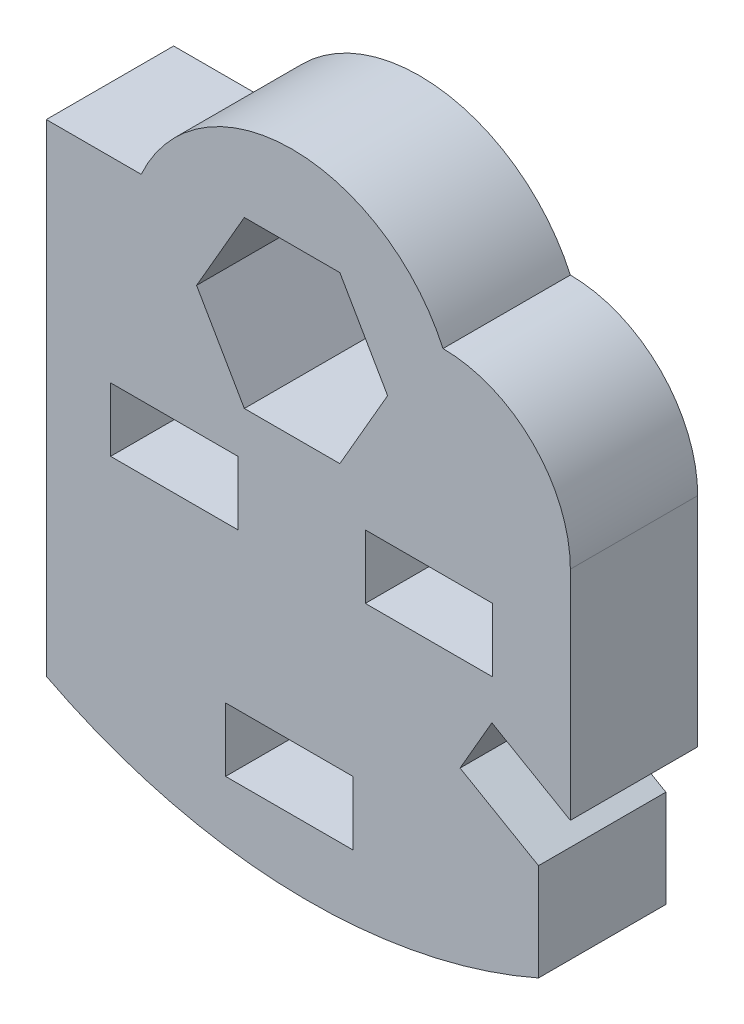
ISO-10303-21;
HEADER;
FILE_DESCRIPTION(('STEP AP214'),'2;1');
FILE_NAME('part.step','',(''),(''),'','','');
FILE_SCHEMA(('AUTOMOTIVE_DESIGN { 1 0 10303 214 1 1 1 1 }'));
ENDSEC;
DATA;
#1=APPLICATION_CONTEXT('core data for automotive mechanical design processes');
#2=APPLICATION_PROTOCOL_DEFINITION('international standard','automotive_design',2000,#1);
#3=PRODUCT_CONTEXT('',#1,'mechanical');
#4=PRODUCT('Part','Part','',(#3));
#5=PRODUCT_RELATED_PRODUCT_CATEGORY('part','',(#4));
#6=PRODUCT_DEFINITION_FORMATION('','',#4);
#7=PRODUCT_DEFINITION_CONTEXT('part definition',#1,'design');
#8=PRODUCT_DEFINITION('design','',#6,#7);
#9=PRODUCT_DEFINITION_SHAPE('','',#8);
#10=(LENGTH_UNIT() NAMED_UNIT(*) SI_UNIT(.MILLI.,.METRE.));
#11=(NAMED_UNIT(*) PLANE_ANGLE_UNIT() SI_UNIT($,.RADIAN.));
#12=(NAMED_UNIT(*) SI_UNIT($,.STERADIAN.) SOLID_ANGLE_UNIT());
#13=UNCERTAINTY_MEASURE_WITH_UNIT(LENGTH_MEASURE(1.E-05),#10,'distance_accuracy_value','');
#14=(GEOMETRIC_REPRESENTATION_CONTEXT(3) GLOBAL_UNCERTAINTY_ASSIGNED_CONTEXT((#13)) GLOBAL_UNIT_ASSIGNED_CONTEXT((#10,
#11,#12)) REPRESENTATION_CONTEXT('',''));
#15=CARTESIAN_POINT('',(0.,0.,0.));
#16=DIRECTION('',(0.,0.,1.));
#17=DIRECTION('',(1.,0.,0.));
#18=AXIS2_PLACEMENT_3D('',#15,#16,#17);
#19=CARTESIAN_POINT('',(13.9396736813884,13.1425512647541,4.));
#20=DIRECTION('',(0.,0.,1.));
#21=DIRECTION('',(1.,0.,0.));
#22=AXIS2_PLACEMENT_3D('',#19,#20,#21);
#23=PLANE('',#22);
#24=DIRECTION('',(0.,-1.,0.));
#25=VECTOR('',#24,1.);
#26=CARTESIAN_POINT('',(11.5,8.99107807997269,4.));
#27=LINE('',#26,#25);
#28=CARTESIAN_POINT('',(11.5,10.9910780799727,4.));
#29=VERTEX_POINT('',#28);
#30=CARTESIAN_POINT('',(11.5,8.99107807997269,4.));
#31=VERTEX_POINT('',#30);
#32=EDGE_CURVE('E271',#29,#31,#27,.T.);
#33=ORIENTED_EDGE('',*,*,#32,.F.);
#34=DIRECTION('',(-1.,0.,0.));
#35=VECTOR('',#34,1.);
#36=CARTESIAN_POINT('',(11.5,10.9910780799727,4.));
#37=LINE('',#36,#35);
#38=CARTESIAN_POINT('',(15.5,10.9910780799727,4.));
#39=VERTEX_POINT('',#38);
#40=EDGE_CURVE('E269',#39,#29,#37,.T.);
#41=ORIENTED_EDGE('',*,*,#40,.F.);
#42=DIRECTION('',(0.,1.,0.));
#43=VECTOR('',#42,1.);
#44=CARTESIAN_POINT('',(15.5,8.99107807997269,4.));
#45=LINE('',#44,#43);
#46=CARTESIAN_POINT('',(15.5,8.99107807997269,4.));
#47=VERTEX_POINT('',#46);
#48=EDGE_CURVE('E277',#47,#39,#45,.T.);
#49=ORIENTED_EDGE('',*,*,#48,.F.);
#50=DIRECTION('',(1.,0.,0.));
#51=VECTOR('',#50,1.);
#52=CARTESIAN_POINT('',(11.5,8.99107807997269,4.));
#53=LINE('',#52,#51);
#54=EDGE_CURVE('E274',#31,#47,#53,.T.);
#55=ORIENTED_EDGE('',*,*,#54,.F.);
#56=EDGE_LOOP('',(#33,#41,#49,#55));
#57=FACE_BOUND('',#56,.T.);
#58=DIRECTION('',(0.,-1.,0.));
#59=VECTOR('',#58,1.);
#60=CARTESIAN_POINT('',(7.11105611722977,2.0910780799727,4.));
#61=LINE('',#60,#59);
#62=CARTESIAN_POINT('',(7.11105611722977,4.0910780799727,4.));
#63=VERTEX_POINT('',#62);
#64=CARTESIAN_POINT('',(7.11105611722977,2.0910780799727,4.));
#65=VERTEX_POINT('',#64);
#66=EDGE_CURVE('E333',#63,#65,#61,.T.);
#67=ORIENTED_EDGE('',*,*,#66,.F.);
#68=DIRECTION('',(-1.,0.,0.));
#69=VECTOR('',#68,1.);
#70=CARTESIAN_POINT('',(7.11105611722977,4.0910780799727,4.));
#71=LINE('',#70,#69);
#72=CARTESIAN_POINT('',(11.1110561172298,4.0910780799727,4.));
#73=VERTEX_POINT('',#72);
#74=EDGE_CURVE('E331',#73,#63,#71,.T.);
#75=ORIENTED_EDGE('',*,*,#74,.F.);
#76=DIRECTION('',(0.,1.,0.));
#77=VECTOR('',#76,1.);
#78=CARTESIAN_POINT('',(11.1110561172298,2.0910780799727,4.));
#79=LINE('',#78,#77);
#80=CARTESIAN_POINT('',(11.1110561172298,2.0910780799727,4.));
#81=VERTEX_POINT('',#80);
#82=EDGE_CURVE('E339',#81,#73,#79,.T.);
#83=ORIENTED_EDGE('',*,*,#82,.F.);
#84=DIRECTION('',(1.,0.,0.));
#85=VECTOR('',#84,1.);
#86=CARTESIAN_POINT('',(7.11105611722977,2.0910780799727,4.));
#87=LINE('',#86,#85);
#88=EDGE_CURVE('E336',#65,#81,#87,.T.);
#89=ORIENTED_EDGE('',*,*,#88,.F.);
#90=EDGE_LOOP('',(#67,#75,#83,#89));
#91=FACE_BOUND('',#90,.T.);
#92=CARTESIAN_POINT('',(13.9396736813884,13.1425512647541,4.));
#93=DIRECTION('',(0.,0.,1.));
#94=DIRECTION('',(1.,0.,0.));
#95=AXIS2_PLACEMENT_3D('',#92,#93,#94);
#96=CIRCLE('',#95,4.);
#97=CARTESIAN_POINT('',(17.9396736813884,13.142551264754,4.));
#98=VERTEX_POINT('',#97);
#99=CARTESIAN_POINT('',(13.9396736813883,17.1425512647541,4.));
#100=VERTEX_POINT('',#99);
#101=EDGE_CURVE('E362',#98,#100,#96,.T.);
#102=ORIENTED_EDGE('',*,*,#101,.T.);
#103=CARTESIAN_POINT('',(9.20000000000002,14.992551264754,4.));
#104=DIRECTION('',(0.,0.,1.));
#105=DIRECTION('',(1.,0.,0.));
#106=AXIS2_PLACEMENT_3D('',#103,#104,#105);
#107=CIRCLE('',#106,5.20451790332642);
#108=CARTESIAN_POINT('',(4.46032631861171,17.1425512647541,4.));
#109=VERTEX_POINT('',#108);
#110=EDGE_CURVE('E365',#100,#109,#107,.T.);
#111=ORIENTED_EDGE('',*,*,#110,.T.);
#112=DIRECTION('',(-1.,0.,0.));
#113=VECTOR('',#112,1.);
#114=CARTESIAN_POINT('',(4.46032631861171,17.1425512647541,4.));
#115=LINE('',#114,#113);
#116=CARTESIAN_POINT('',(1.48,17.1425512647541,4.));
#117=VERTEX_POINT('',#116);
#118=EDGE_CURVE('E368',#109,#117,#115,.T.);
#119=ORIENTED_EDGE('',*,*,#118,.T.);
#120=DIRECTION('',(0.,-1.,0.));
#121=VECTOR('',#120,1.);
#122=CARTESIAN_POINT('',(1.48,17.1425512647541,4.));
#123=LINE('',#122,#121);
#124=CARTESIAN_POINT('',(1.47999999999999,2.,4.));
#125=VERTEX_POINT('',#124);
#126=EDGE_CURVE('E370',#117,#125,#123,.T.);
#127=ORIENTED_EDGE('',*,*,#126,.T.);
#128=CARTESIAN_POINT('',(9.70983684069418,17.9325536061118,4.));
#129=DIRECTION('',(0.,0.,1.));
#130=DIRECTION('',(1.,0.,0.));
#131=AXIS2_PLACEMENT_3D('',#128,#129,#130);
#132=CIRCLE('',#131,17.9325536061118);
#133=CARTESIAN_POINT('',(16.9396736813884,1.52201010222338,4.));
#134=VERTEX_POINT('',#133);
#135=EDGE_CURVE('E372',#125,#134,#132,.T.);
#136=ORIENTED_EDGE('',*,*,#135,.T.);
#137=DIRECTION('',(0.,1.,0.));
#138=VECTOR('',#137,1.);
#139=CARTESIAN_POINT('',(16.9396736813884,4.57735026918963,4.));
#140=LINE('',#139,#138);
#141=CARTESIAN_POINT('',(16.9396736813884,4.57735026918963,4.));
#142=VERTEX_POINT('',#141);
#143=EDGE_CURVE('E374',#134,#142,#140,.T.);
#144=ORIENTED_EDGE('',*,*,#143,.T.);
#145=DIRECTION('',(-0.866025403784438,0.5,0.));
#146=VECTOR('',#145,1.);
#147=CARTESIAN_POINT('',(14.4755720662506,6.,4.));
#148=LINE('',#147,#146);
#149=CARTESIAN_POINT('',(14.4755720662506,6.,4.));
#150=VERTEX_POINT('',#149);
#151=EDGE_CURVE('E376',#142,#150,#148,.T.);
#152=ORIENTED_EDGE('',*,*,#151,.T.);
#153=DIRECTION('',(0.500000000000005,0.866025403784436,0.));
#154=VECTOR('',#153,1.);
#155=CARTESIAN_POINT('',(14.4755720662506,6.,4.));
#156=LINE('',#155,#154);
#157=CARTESIAN_POINT('',(15.4755720662506,7.73205080756889,4.));
#158=VERTEX_POINT('',#157);
#159=EDGE_CURVE('E378',#150,#158,#156,.T.);
#160=ORIENTED_EDGE('',*,*,#159,.T.);
#161=DIRECTION('',(0.866025403784436,-0.500000000000005,0.));
#162=VECTOR('',#161,1.);
#163=CARTESIAN_POINT('',(15.4755720662506,7.73205080756889,4.));
#164=LINE('',#163,#162);
#165=CARTESIAN_POINT('',(17.9396736813884,6.30940107675851,4.));
#166=VERTEX_POINT('',#165);
#167=EDGE_CURVE('E380',#158,#166,#164,.T.);
#168=ORIENTED_EDGE('',*,*,#167,.T.);
#169=DIRECTION('',(0.,1.,0.));
#170=VECTOR('',#169,1.);
#171=CARTESIAN_POINT('',(17.9396736813884,13.142551264754,4.));
#172=LINE('',#171,#170);
#173=EDGE_CURVE('E382',#166,#98,#172,.T.);
#174=ORIENTED_EDGE('',*,*,#173,.T.);
#175=EDGE_LOOP('',(#102,#111,#119,#127,#136,#144,#152,#160,#168,#174));
#176=FACE_BOUND('',#175,.T.);
#177=DIRECTION('',(0.,-1.,0.));
#178=VECTOR('',#177,1.);
#179=CARTESIAN_POINT('',(3.5,8.99107807997269,4.));
#180=LINE('',#179,#178);
#181=CARTESIAN_POINT('',(3.5,10.9910780799727,4.));
#182=VERTEX_POINT('',#181);
#183=CARTESIAN_POINT('',(3.5,8.99107807997269,4.));
#184=VERTEX_POINT('',#183);
#185=EDGE_CURVE('E302',#182,#184,#180,.T.);
#186=ORIENTED_EDGE('',*,*,#185,.F.);
#187=DIRECTION('',(-1.,0.,0.));
#188=VECTOR('',#187,1.);
#189=CARTESIAN_POINT('',(3.5,10.9910780799727,4.));
#190=LINE('',#189,#188);
#191=CARTESIAN_POINT('',(7.5,10.9910780799727,4.));
#192=VERTEX_POINT('',#191);
#193=EDGE_CURVE('E300',#192,#182,#190,.T.);
#194=ORIENTED_EDGE('',*,*,#193,.F.);
#195=DIRECTION('',(0.,1.,0.));
#196=VECTOR('',#195,1.);
#197=CARTESIAN_POINT('',(7.5,8.99107807997269,4.));
#198=LINE('',#197,#196);
#199=CARTESIAN_POINT('',(7.5,8.99107807997269,4.));
#200=VERTEX_POINT('',#199);
#201=EDGE_CURVE('E308',#200,#192,#198,.T.);
#202=ORIENTED_EDGE('',*,*,#201,.F.);
#203=DIRECTION('',(1.,0.,0.));
#204=VECTOR('',#203,1.);
#205=CARTESIAN_POINT('',(3.5,8.99107807997269,4.));
#206=LINE('',#205,#204);
#207=EDGE_CURVE('E305',#184,#200,#206,.T.);
#208=ORIENTED_EDGE('',*,*,#207,.F.);
#209=EDGE_LOOP('',(#186,#194,#202,#208));
#210=FACE_BOUND('',#209,.T.);
#211=DIRECTION('',(0.500000000000001,-0.866025403784438,0.));
#212=VECTOR('',#211,1.);
#213=CARTESIAN_POINT('',(6.20000000000001,14.9910780799727,4.));
#214=LINE('',#213,#212);
#215=CARTESIAN_POINT('',(6.20000000000001,14.9910780799727,4.));
#216=VERTEX_POINT('',#215);
#217=CARTESIAN_POINT('',(7.70000000000002,12.3930018686194,4.));
#218=VERTEX_POINT('',#217);
#219=EDGE_CURVE('E226',#216,#218,#214,.T.);
#220=ORIENTED_EDGE('',*,*,#219,.F.);
#221=DIRECTION('',(-0.499999999999995,-0.866025403784442,0.));
#222=VECTOR('',#221,1.);
#223=CARTESIAN_POINT('',(7.69999999999998,17.589154291326,4.));
#224=LINE('',#223,#222);
#225=CARTESIAN_POINT('',(7.69999999999998,17.589154291326,4.));
#226=VERTEX_POINT('',#225);
#227=EDGE_CURVE('E218',#226,#216,#224,.T.);
#228=ORIENTED_EDGE('',*,*,#227,.F.);
#229=DIRECTION('',(-1.,0.,0.));
#230=VECTOR('',#229,1.);
#231=CARTESIAN_POINT('',(10.7,17.589154291326,4.));
#232=LINE('',#231,#230);
#233=CARTESIAN_POINT('',(10.7,17.589154291326,4.));
#234=VERTEX_POINT('',#233);
#235=EDGE_CURVE('E247',#234,#226,#232,.T.);
#236=ORIENTED_EDGE('',*,*,#235,.F.);
#237=DIRECTION('',(-0.500000000000007,0.866025403784435,0.));
#238=VECTOR('',#237,1.);
#239=CARTESIAN_POINT('',(12.2,14.9910780799727,4.));
#240=LINE('',#239,#238);
#241=CARTESIAN_POINT('',(12.2,14.9910780799727,4.));
#242=VERTEX_POINT('',#241);
#243=EDGE_CURVE('E245',#242,#234,#240,.T.);
#244=ORIENTED_EDGE('',*,*,#243,.F.);
#245=DIRECTION('',(0.499999999999995,0.866025403784442,0.));
#246=VECTOR('',#245,1.);
#247=CARTESIAN_POINT('',(10.7,12.3930018686194,4.));
#248=LINE('',#247,#246);
#249=CARTESIAN_POINT('',(10.7,12.3930018686194,4.));
#250=VERTEX_POINT('',#249);
#251=EDGE_CURVE('E241',#250,#242,#248,.T.);
#252=ORIENTED_EDGE('',*,*,#251,.F.);
#253=DIRECTION('',(1.,0.,0.));
#254=VECTOR('',#253,1.);
#255=CARTESIAN_POINT('',(7.70000000000002,12.3930018686194,4.));
#256=LINE('',#255,#254);
#257=EDGE_CURVE('E239',#218,#250,#256,.T.);
#258=ORIENTED_EDGE('',*,*,#257,.F.);
#259=EDGE_LOOP('',(#220,#228,#236,#244,#252,#258));
#260=FACE_BOUND('',#259,.T.);
#261=ADVANCED_FACE('F33',(#57,#91,#176,#210,#260),#23,.T.);
#262=CARTESIAN_POINT('',(13.9396736813884,13.1425512647541,0.));
#263=DIRECTION('',(0.,0.,1.));
#264=DIRECTION('',(1.,0.,0.));
#265=AXIS2_PLACEMENT_3D('',#262,#263,#264);
#266=PLANE('',#265);
#267=DIRECTION('',(-1.,0.,0.));
#268=VECTOR('',#267,1.);
#269=CARTESIAN_POINT('',(11.5,10.9910780799727,0.));
#270=LINE('',#269,#268);
#271=CARTESIAN_POINT('',(15.5,10.9910780799727,0.));
#272=VERTEX_POINT('',#271);
#273=CARTESIAN_POINT('',(11.5,10.9910780799727,0.));
#274=VERTEX_POINT('',#273);
#275=EDGE_CURVE('E234',#272,#274,#270,.T.);
#276=ORIENTED_EDGE('',*,*,#275,.T.);
#277=DIRECTION('',(0.,-1.,0.));
#278=VECTOR('',#277,1.);
#279=CARTESIAN_POINT('',(11.5,8.99107807997269,0.));
#280=LINE('',#279,#278);
#281=CARTESIAN_POINT('',(11.5,8.99107807997269,0.));
#282=VERTEX_POINT('',#281);
#283=EDGE_CURVE('E282',#274,#282,#280,.T.);
#284=ORIENTED_EDGE('',*,*,#283,.T.);
#285=DIRECTION('',(1.,0.,0.));
#286=VECTOR('',#285,1.);
#287=CARTESIAN_POINT('',(11.5,8.99107807997269,0.));
#288=LINE('',#287,#286);
#289=CARTESIAN_POINT('',(15.5,8.99107807997269,0.));
#290=VERTEX_POINT('',#289);
#291=EDGE_CURVE('E285',#282,#290,#288,.T.);
#292=ORIENTED_EDGE('',*,*,#291,.T.);
#293=DIRECTION('',(0.,1.,0.));
#294=VECTOR('',#293,1.);
#295=CARTESIAN_POINT('',(15.5,8.99107807997269,0.));
#296=LINE('',#295,#294);
#297=EDGE_CURVE('E272',#290,#272,#296,.T.);
#298=ORIENTED_EDGE('',*,*,#297,.T.);
#299=EDGE_LOOP('',(#276,#284,#292,#298));
#300=FACE_BOUND('',#299,.T.);
#301=DIRECTION('',(-1.,0.,0.));
#302=VECTOR('',#301,1.);
#303=CARTESIAN_POINT('',(7.11105611722977,4.0910780799727,0.));
#304=LINE('',#303,#302);
#305=CARTESIAN_POINT('',(11.1110561172298,4.0910780799727,0.));
#306=VERTEX_POINT('',#305);
#307=CARTESIAN_POINT('',(7.11105611722977,4.0910780799727,0.));
#308=VERTEX_POINT('',#307);
#309=EDGE_CURVE('E330',#306,#308,#304,.T.);
#310=ORIENTED_EDGE('',*,*,#309,.T.);
#311=DIRECTION('',(0.,-1.,0.));
#312=VECTOR('',#311,1.);
#313=CARTESIAN_POINT('',(7.11105611722977,2.0910780799727,0.));
#314=LINE('',#313,#312);
#315=CARTESIAN_POINT('',(7.11105611722977,2.0910780799727,0.));
#316=VERTEX_POINT('',#315);
#317=EDGE_CURVE('E344',#308,#316,#314,.T.);
#318=ORIENTED_EDGE('',*,*,#317,.T.);
#319=DIRECTION('',(1.,0.,0.));
#320=VECTOR('',#319,1.);
#321=CARTESIAN_POINT('',(7.11105611722977,2.0910780799727,0.));
#322=LINE('',#321,#320);
#323=CARTESIAN_POINT('',(11.1110561172298,2.0910780799727,0.));
#324=VERTEX_POINT('',#323);
#325=EDGE_CURVE('E347',#316,#324,#322,.T.);
#326=ORIENTED_EDGE('',*,*,#325,.T.);
#327=DIRECTION('',(0.,1.,0.));
#328=VECTOR('',#327,1.);
#329=CARTESIAN_POINT('',(11.1110561172298,2.0910780799727,0.));
#330=LINE('',#329,#328);
#331=EDGE_CURVE('E334',#324,#306,#330,.T.);
#332=ORIENTED_EDGE('',*,*,#331,.T.);
#333=EDGE_LOOP('',(#310,#318,#326,#332));
#334=FACE_BOUND('',#333,.T.);
#335=CARTESIAN_POINT('',(13.9396736813884,13.1425512647541,0.));
#336=DIRECTION('',(0.,0.,1.));
#337=DIRECTION('',(1.,0.,0.));
#338=AXIS2_PLACEMENT_3D('',#335,#336,#337);
#339=CIRCLE('',#338,4.);
#340=CARTESIAN_POINT('',(17.9396736813884,13.142551264754,0.));
#341=VERTEX_POINT('',#340);
#342=CARTESIAN_POINT('',(13.9396736813883,17.1425512647541,0.));
#343=VERTEX_POINT('',#342);
#344=EDGE_CURVE('E361',#341,#343,#339,.T.);
#345=ORIENTED_EDGE('',*,*,#344,.F.);
#346=DIRECTION('',(0.,1.,0.));
#347=VECTOR('',#346,1.);
#348=CARTESIAN_POINT('',(17.9396736813884,13.142551264754,0.));
#349=LINE('',#348,#347);
#350=CARTESIAN_POINT('',(17.9396736813884,6.30940107675851,0.));
#351=VERTEX_POINT('',#350);
#352=EDGE_CURVE('E366',#351,#341,#349,.T.);
#353=ORIENTED_EDGE('',*,*,#352,.F.);
#354=DIRECTION('',(0.866025403784436,-0.500000000000005,0.));
#355=VECTOR('',#354,1.);
#356=CARTESIAN_POINT('',(15.4755720662506,7.73205080756889,0.));
#357=LINE('',#356,#355);
#358=CARTESIAN_POINT('',(15.4755720662506,7.73205080756889,0.));
#359=VERTEX_POINT('',#358);
#360=EDGE_CURVE('E401',#359,#351,#357,.T.);
#361=ORIENTED_EDGE('',*,*,#360,.F.);
#362=DIRECTION('',(0.500000000000005,0.866025403784436,0.));
#363=VECTOR('',#362,1.);
#364=CARTESIAN_POINT('',(14.4755720662506,6.,0.));
#365=LINE('',#364,#363);
#366=CARTESIAN_POINT('',(14.4755720662506,6.,0.));
#367=VERTEX_POINT('',#366);
#368=EDGE_CURVE('E399',#367,#359,#365,.T.);
#369=ORIENTED_EDGE('',*,*,#368,.F.);
#370=DIRECTION('',(-0.866025403784438,0.5,0.));
#371=VECTOR('',#370,1.);
#372=CARTESIAN_POINT('',(14.4755720662506,6.,0.));
#373=LINE('',#372,#371);
#374=CARTESIAN_POINT('',(16.9396736813884,4.57735026918963,0.));
#375=VERTEX_POINT('',#374);
#376=EDGE_CURVE('E397',#375,#367,#373,.T.);
#377=ORIENTED_EDGE('',*,*,#376,.F.);
#378=DIRECTION('',(0.,1.,0.));
#379=VECTOR('',#378,1.);
#380=CARTESIAN_POINT('',(16.9396736813884,4.57735026918963,0.));
#381=LINE('',#380,#379);
#382=CARTESIAN_POINT('',(16.9396736813884,1.52201010222338,0.));
#383=VERTEX_POINT('',#382);
#384=EDGE_CURVE('E395',#383,#375,#381,.T.);
#385=ORIENTED_EDGE('',*,*,#384,.F.);
#386=CARTESIAN_POINT('',(9.70983684069418,17.9325536061118,0.));
#387=DIRECTION('',(0.,0.,1.));
#388=DIRECTION('',(1.,0.,0.));
#389=AXIS2_PLACEMENT_3D('',#386,#387,#388);
#390=CIRCLE('',#389,17.9325536061118);
#391=CARTESIAN_POINT('',(1.47999999999999,2.,0.));
#392=VERTEX_POINT('',#391);
#393=EDGE_CURVE('E393',#392,#383,#390,.T.);
#394=ORIENTED_EDGE('',*,*,#393,.F.);
#395=DIRECTION('',(0.,-1.,0.));
#396=VECTOR('',#395,1.);
#397=CARTESIAN_POINT('',(1.48,17.1425512647541,0.));
#398=LINE('',#397,#396);
#399=CARTESIAN_POINT('',(1.48,17.1425512647541,0.));
#400=VERTEX_POINT('',#399);
#401=EDGE_CURVE('E391',#400,#392,#398,.T.);
#402=ORIENTED_EDGE('',*,*,#401,.F.);
#403=DIRECTION('',(-1.,0.,0.));
#404=VECTOR('',#403,1.);
#405=CARTESIAN_POINT('',(4.46032631861171,17.1425512647541,0.));
#406=LINE('',#405,#404);
#407=CARTESIAN_POINT('',(4.46032631861171,17.1425512647541,0.));
#408=VERTEX_POINT('',#407);
#409=EDGE_CURVE('E389',#408,#400,#406,.T.);
#410=ORIENTED_EDGE('',*,*,#409,.F.);
#411=CARTESIAN_POINT('',(9.20000000000002,14.992551264754,0.));
#412=DIRECTION('',(0.,0.,1.));
#413=DIRECTION('',(1.,0.,0.));
#414=AXIS2_PLACEMENT_3D('',#411,#412,#413);
#415=CIRCLE('',#414,5.20451790332642);
#416=EDGE_CURVE('E387',#343,#408,#415,.T.);
#417=ORIENTED_EDGE('',*,*,#416,.F.);
#418=EDGE_LOOP('',(#345,#353,#361,#369,#377,#385,#394,#402,#410,#417));
#419=FACE_BOUND('',#418,.T.);
#420=DIRECTION('',(-1.,0.,0.));
#421=VECTOR('',#420,1.);
#422=CARTESIAN_POINT('',(3.5,10.9910780799727,0.));
#423=LINE('',#422,#421);
#424=CARTESIAN_POINT('',(7.5,10.9910780799727,0.));
#425=VERTEX_POINT('',#424);
#426=CARTESIAN_POINT('',(3.5,10.9910780799727,0.));
#427=VERTEX_POINT('',#426);
#428=EDGE_CURVE('E299',#425,#427,#423,.T.);
#429=ORIENTED_EDGE('',*,*,#428,.T.);
#430=DIRECTION('',(0.,-1.,0.));
#431=VECTOR('',#430,1.);
#432=CARTESIAN_POINT('',(3.5,8.99107807997269,0.));
#433=LINE('',#432,#431);
#434=CARTESIAN_POINT('',(3.5,8.99107807997269,0.));
#435=VERTEX_POINT('',#434);
#436=EDGE_CURVE('E313',#427,#435,#433,.T.);
#437=ORIENTED_EDGE('',*,*,#436,.T.);
#438=DIRECTION('',(1.,0.,0.));
#439=VECTOR('',#438,1.);
#440=CARTESIAN_POINT('',(3.5,8.99107807997269,0.));
#441=LINE('',#440,#439);
#442=CARTESIAN_POINT('',(7.5,8.99107807997269,0.));
#443=VERTEX_POINT('',#442);
#444=EDGE_CURVE('E316',#435,#443,#441,.T.);
#445=ORIENTED_EDGE('',*,*,#444,.T.);
#446=DIRECTION('',(0.,1.,0.));
#447=VECTOR('',#446,1.);
#448=CARTESIAN_POINT('',(7.5,8.99107807997269,0.));
#449=LINE('',#448,#447);
#450=EDGE_CURVE('E303',#443,#425,#449,.T.);
#451=ORIENTED_EDGE('',*,*,#450,.T.);
#452=EDGE_LOOP('',(#429,#437,#445,#451));
#453=FACE_BOUND('',#452,.T.);
#454=DIRECTION('',(-0.499999999999995,-0.866025403784442,0.));
#455=VECTOR('',#454,1.);
#456=CARTESIAN_POINT('',(7.69999999999998,17.589154291326,0.));
#457=LINE('',#456,#455);
#458=CARTESIAN_POINT('',(7.69999999999998,17.589154291326,0.));
#459=VERTEX_POINT('',#458);
#460=CARTESIAN_POINT('',(6.20000000000001,14.9910780799727,0.));
#461=VERTEX_POINT('',#460);
#462=EDGE_CURVE('E56',#459,#461,#457,.T.);
#463=ORIENTED_EDGE('',*,*,#462,.T.);
#464=DIRECTION('',(0.500000000000001,-0.866025403784438,0.));
#465=VECTOR('',#464,1.);
#466=CARTESIAN_POINT('',(6.20000000000001,14.9910780799727,0.));
#467=LINE('',#466,#465);
#468=CARTESIAN_POINT('',(7.70000000000002,12.3930018686194,0.));
#469=VERTEX_POINT('',#468);
#470=EDGE_CURVE('E233',#461,#469,#467,.T.);
#471=ORIENTED_EDGE('',*,*,#470,.T.);
#472=DIRECTION('',(1.,0.,0.));
#473=VECTOR('',#472,1.);
#474=CARTESIAN_POINT('',(7.70000000000002,12.3930018686194,0.));
#475=LINE('',#474,#473);
#476=CARTESIAN_POINT('',(10.7,12.3930018686194,0.));
#477=VERTEX_POINT('',#476);
#478=EDGE_CURVE('E251',#469,#477,#475,.T.);
#479=ORIENTED_EDGE('',*,*,#478,.T.);
#480=DIRECTION('',(0.499999999999995,0.866025403784442,0.));
#481=VECTOR('',#480,1.);
#482=CARTESIAN_POINT('',(10.7,12.3930018686194,0.));
#483=LINE('',#482,#481);
#484=CARTESIAN_POINT('',(12.2,14.9910780799727,0.));
#485=VERTEX_POINT('',#484);
#486=EDGE_CURVE('E254',#477,#485,#483,.T.);
#487=ORIENTED_EDGE('',*,*,#486,.T.);
#488=DIRECTION('',(-0.500000000000007,0.866025403784435,0.));
#489=VECTOR('',#488,1.);
#490=CARTESIAN_POINT('',(12.2,14.9910780799727,0.));
#491=LINE('',#490,#489);
#492=CARTESIAN_POINT('',(10.7,17.589154291326,0.));
#493=VERTEX_POINT('',#492);
#494=EDGE_CURVE('E257',#485,#493,#491,.T.);
#495=ORIENTED_EDGE('',*,*,#494,.T.);
#496=DIRECTION('',(-1.,0.,0.));
#497=VECTOR('',#496,1.);
#498=CARTESIAN_POINT('',(10.7,17.589154291326,0.));
#499=LINE('',#498,#497);
#500=EDGE_CURVE('E227',#493,#459,#499,.T.);
#501=ORIENTED_EDGE('',*,*,#500,.T.);
#502=EDGE_LOOP('',(#463,#471,#479,#487,#495,#501));
#503=FACE_BOUND('',#502,.T.);
#504=ADVANCED_FACE('F437',(#300,#334,#419,#453,#503),#266,.F.);
#505=CARTESIAN_POINT('',(13.9396736813884,13.1425512647541,4.));
#506=DIRECTION('',(0.,0.,-1.));
#507=DIRECTION('',(-1.,0.,0.));
#508=AXIS2_PLACEMENT_3D('',#505,#506,#507);
#509=CYLINDRICAL_SURFACE('',#508,4.);
#510=ORIENTED_EDGE('',*,*,#344,.T.);
#511=DIRECTION('',(0.,0.,-1.));
#512=VECTOR('',#511,1.);
#513=CARTESIAN_POINT('',(13.9396736813883,17.1425512647541,4.));
#514=LINE('',#513,#512);
#515=EDGE_CURVE('E11',#100,#343,#514,.T.);
#516=ORIENTED_EDGE('',*,*,#515,.F.);
#517=ORIENTED_EDGE('',*,*,#101,.F.);
#518=DIRECTION('',(0.,0.,-1.));
#519=VECTOR('',#518,1.);
#520=CARTESIAN_POINT('',(17.9396736813884,13.142551264754,4.));
#521=LINE('',#520,#519);
#522=EDGE_CURVE('E384',#98,#341,#521,.T.);
#523=ORIENTED_EDGE('',*,*,#522,.T.);
#524=EDGE_LOOP('',(#510,#516,#517,#523));
#525=FACE_BOUND('',#524,.T.);
#526=ADVANCED_FACE('F35',(#525),#509,.T.);
#527=CARTESIAN_POINT('',(9.20000000000002,14.992551264754,4.));
#528=DIRECTION('',(0.,0.,-1.));
#529=DIRECTION('',(-1.,0.,0.));
#530=AXIS2_PLACEMENT_3D('',#527,#528,#529);
#531=CYLINDRICAL_SURFACE('',#530,5.20451790332642);
#532=ORIENTED_EDGE('',*,*,#416,.T.);
#533=DIRECTION('',(0.,0.,-1.));
#534=VECTOR('',#533,1.);
#535=CARTESIAN_POINT('',(4.46032631861171,17.1425512647541,4.));
#536=LINE('',#535,#534);
#537=EDGE_CURVE('E41',#109,#408,#536,.T.);
#538=ORIENTED_EDGE('',*,*,#537,.F.);
#539=ORIENTED_EDGE('',*,*,#110,.F.);
#540=ORIENTED_EDGE('',*,*,#515,.T.);
#541=EDGE_LOOP('',(#532,#538,#539,#540));
#542=FACE_BOUND('',#541,.T.);
#543=ADVANCED_FACE('F455',(#542),#531,.T.);
#544=CARTESIAN_POINT('',(4.46032631861171,17.1425512647541,4.));
#545=DIRECTION('',(0.,-1.,0.));
#546=DIRECTION('',(0.,0.,-1.));
#547=AXIS2_PLACEMENT_3D('',#544,#545,#546);
#548=PLANE('',#547);
#549=ORIENTED_EDGE('',*,*,#409,.T.);
#550=DIRECTION('',(0.,0.,-1.));
#551=VECTOR('',#550,1.);
#552=CARTESIAN_POINT('',(1.48,17.1425512647541,4.));
#553=LINE('',#552,#551);
#554=EDGE_CURVE('E424',#117,#400,#553,.T.);
#555=ORIENTED_EDGE('',*,*,#554,.F.);
#556=ORIENTED_EDGE('',*,*,#118,.F.);
#557=ORIENTED_EDGE('',*,*,#537,.T.);
#558=EDGE_LOOP('',(#549,#555,#556,#557));
#559=FACE_BOUND('',#558,.T.);
#560=ADVANCED_FACE('F431',(#559),#548,.F.);
#561=CARTESIAN_POINT('',(1.48,17.1425512647541,4.));
#562=DIRECTION('',(1.,0.,0.));
#563=DIRECTION('',(0.,1.,0.));
#564=AXIS2_PLACEMENT_3D('',#561,#562,#563);
#565=PLANE('',#564);
#566=ORIENTED_EDGE('',*,*,#401,.T.);
#567=DIRECTION('',(0.,0.,-1.));
#568=VECTOR('',#567,1.);
#569=CARTESIAN_POINT('',(1.47999999999999,2.,4.));
#570=LINE('',#569,#568);
#571=EDGE_CURVE('E421',#125,#392,#570,.T.);
#572=ORIENTED_EDGE('',*,*,#571,.F.);
#573=ORIENTED_EDGE('',*,*,#126,.F.);
#574=ORIENTED_EDGE('',*,*,#554,.T.);
#575=EDGE_LOOP('',(#566,#572,#573,#574));
#576=FACE_BOUND('',#575,.T.);
#577=ADVANCED_FACE('F443',(#576),#565,.F.);
#578=CARTESIAN_POINT('',(9.70983684069418,17.9325536061118,4.));
#579=DIRECTION('',(0.,0.,-1.));
#580=DIRECTION('',(-1.,0.,0.));
#581=AXIS2_PLACEMENT_3D('',#578,#579,#580);
#582=CYLINDRICAL_SURFACE('',#581,17.9325536061118);
#583=ORIENTED_EDGE('',*,*,#393,.T.);
#584=DIRECTION('',(0.,0.,-1.));
#585=VECTOR('',#584,1.);
#586=CARTESIAN_POINT('',(16.9396736813884,1.52201010222338,4.));
#587=LINE('',#586,#585);
#588=EDGE_CURVE('E418',#134,#383,#587,.T.);
#589=ORIENTED_EDGE('',*,*,#588,.F.);
#590=ORIENTED_EDGE('',*,*,#135,.F.);
#591=ORIENTED_EDGE('',*,*,#571,.T.);
#592=EDGE_LOOP('',(#583,#589,#590,#591));
#593=FACE_BOUND('',#592,.T.);
#594=ADVANCED_FACE('F447',(#593),#582,.T.);
#595=CARTESIAN_POINT('',(16.9396736813884,4.57735026918963,4.));
#596=DIRECTION('',(-1.,0.,0.));
#597=DIRECTION('',(0.,0.,1.));
#598=AXIS2_PLACEMENT_3D('',#595,#596,#597);
#599=PLANE('',#598);
#600=ORIENTED_EDGE('',*,*,#384,.T.);
#601=DIRECTION('',(0.,0.,-1.));
#602=VECTOR('',#601,1.);
#603=CARTESIAN_POINT('',(16.9396736813884,4.57735026918963,4.));
#604=LINE('',#603,#602);
#605=EDGE_CURVE('E415',#142,#375,#604,.T.);
#606=ORIENTED_EDGE('',*,*,#605,.F.);
#607=ORIENTED_EDGE('',*,*,#143,.F.);
#608=ORIENTED_EDGE('',*,*,#588,.T.);
#609=EDGE_LOOP('',(#600,#606,#607,#608));
#610=FACE_BOUND('',#609,.T.);
#611=ADVANCED_FACE('F478',(#610),#599,.F.);
#612=CARTESIAN_POINT('',(14.4755720662506,6.,4.));
#613=DIRECTION('',(-0.5,-0.866025403784438,0.));
#614=DIRECTION('',(0.866025403784438,-0.5,0.));
#615=AXIS2_PLACEMENT_3D('',#612,#613,#614);
#616=PLANE('',#615);
#617=ORIENTED_EDGE('',*,*,#376,.T.);
#618=DIRECTION('',(0.,0.,-1.));
#619=VECTOR('',#618,1.);
#620=CARTESIAN_POINT('',(14.4755720662506,6.,4.));
#621=LINE('',#620,#619);
#622=EDGE_CURVE('E412',#150,#367,#621,.T.);
#623=ORIENTED_EDGE('',*,*,#622,.F.);
#624=ORIENTED_EDGE('',*,*,#151,.F.);
#625=ORIENTED_EDGE('',*,*,#605,.T.);
#626=EDGE_LOOP('',(#617,#623,#624,#625));
#627=FACE_BOUND('',#626,.T.);
#628=ADVANCED_FACE('F475',(#627),#616,.F.);
#629=CARTESIAN_POINT('',(14.4755720662506,6.,4.));
#630=DIRECTION('',(-0.866025403784436,0.500000000000005,0.));
#631=DIRECTION('',(-0.500000000000005,-0.866025403784436,0.));
#632=AXIS2_PLACEMENT_3D('',#629,#630,#631);
#633=PLANE('',#632);
#634=ORIENTED_EDGE('',*,*,#368,.T.);
#635=DIRECTION('',(0.,0.,-1.));
#636=VECTOR('',#635,1.);
#637=CARTESIAN_POINT('',(15.4755720662506,7.73205080756889,4.));
#638=LINE('',#637,#636);
#639=EDGE_CURVE('E409',#158,#359,#638,.T.);
#640=ORIENTED_EDGE('',*,*,#639,.F.);
#641=ORIENTED_EDGE('',*,*,#159,.F.);
#642=ORIENTED_EDGE('',*,*,#622,.T.);
#643=EDGE_LOOP('',(#634,#640,#641,#642));
#644=FACE_BOUND('',#643,.T.);
#645=ADVANCED_FACE('F471',(#644),#633,.F.);
#646=CARTESIAN_POINT('',(15.4755720662506,7.73205080756889,4.));
#647=DIRECTION('',(0.500000000000005,0.866025403784436,0.));
#648=DIRECTION('',(-0.866025403784436,0.500000000000005,0.));
#649=AXIS2_PLACEMENT_3D('',#646,#647,#648);
#650=PLANE('',#649);
#651=ORIENTED_EDGE('',*,*,#360,.T.);
#652=DIRECTION('',(0.,0.,-1.));
#653=VECTOR('',#652,1.);
#654=CARTESIAN_POINT('',(17.9396736813884,6.30940107675851,4.));
#655=LINE('',#654,#653);
#656=EDGE_CURVE('E406',#166,#351,#655,.T.);
#657=ORIENTED_EDGE('',*,*,#656,.F.);
#658=ORIENTED_EDGE('',*,*,#167,.F.);
#659=ORIENTED_EDGE('',*,*,#639,.T.);
#660=EDGE_LOOP('',(#651,#657,#658,#659));
#661=FACE_BOUND('',#660,.T.);
#662=ADVANCED_FACE('F467',(#661),#650,.F.);
#663=CARTESIAN_POINT('',(17.9396736813884,13.142551264754,4.));
#664=DIRECTION('',(-1.,0.,0.));
#665=DIRECTION('',(0.,0.,1.));
#666=AXIS2_PLACEMENT_3D('',#663,#664,#665);
#667=PLANE('',#666);
#668=ORIENTED_EDGE('',*,*,#352,.T.);
#669=ORIENTED_EDGE('',*,*,#522,.F.);
#670=ORIENTED_EDGE('',*,*,#173,.F.);
#671=ORIENTED_EDGE('',*,*,#656,.T.);
#672=EDGE_LOOP('',(#668,#669,#670,#671));
#673=FACE_BOUND('',#672,.T.);
#674=ADVANCED_FACE('F462',(#673),#667,.F.);
#675=CARTESIAN_POINT('',(7.11105611722977,4.0910780799727,4.));
#676=DIRECTION('',(0.,-1.,0.));
#677=DIRECTION('',(0.,0.,-1.));
#678=AXIS2_PLACEMENT_3D('',#675,#676,#677);
#679=PLANE('',#678);
#680=ORIENTED_EDGE('',*,*,#309,.F.);
#681=DIRECTION('',(0.,0.,-1.));
#682=VECTOR('',#681,1.);
#683=CARTESIAN_POINT('',(11.1110561172298,4.0910780799727,4.));
#684=LINE('',#683,#682);
#685=EDGE_CURVE('E341',#73,#306,#684,.T.);
#686=ORIENTED_EDGE('',*,*,#685,.F.);
#687=ORIENTED_EDGE('',*,*,#74,.T.);
#688=DIRECTION('',(0.,0.,-1.));
#689=VECTOR('',#688,1.);
#690=CARTESIAN_POINT('',(7.11105611722977,4.0910780799727,4.));
#691=LINE('',#690,#689);
#692=EDGE_CURVE('E358',#63,#308,#691,.T.);
#693=ORIENTED_EDGE('',*,*,#692,.T.);
#694=EDGE_LOOP('',(#680,#686,#687,#693));
#695=FACE_BOUND('',#694,.T.);
#696=ADVANCED_FACE('F498',(#695),#679,.T.);
#697=CARTESIAN_POINT('',(7.11105611722977,2.0910780799727,4.));
#698=DIRECTION('',(1.,0.,0.));
#699=DIRECTION('',(0.,0.,-1.));
#700=AXIS2_PLACEMENT_3D('',#697,#698,#699);
#701=PLANE('',#700);
#702=ORIENTED_EDGE('',*,*,#317,.F.);
#703=ORIENTED_EDGE('',*,*,#692,.F.);
#704=ORIENTED_EDGE('',*,*,#66,.T.);
#705=DIRECTION('',(0.,0.,-1.));
#706=VECTOR('',#705,1.);
#707=CARTESIAN_POINT('',(7.11105611722977,2.0910780799727,4.));
#708=LINE('',#707,#706);
#709=EDGE_CURVE('E356',#65,#316,#708,.T.);
#710=ORIENTED_EDGE('',*,*,#709,.T.);
#711=EDGE_LOOP('',(#702,#703,#704,#710));
#712=FACE_BOUND('',#711,.T.);
#713=ADVANCED_FACE('F524',(#712),#701,.T.);
#714=CARTESIAN_POINT('',(7.11105611722977,2.0910780799727,4.));
#715=DIRECTION('',(0.,1.,0.));
#716=DIRECTION('',(0.,0.,1.));
#717=AXIS2_PLACEMENT_3D('',#714,#715,#716);
#718=PLANE('',#717);
#719=ORIENTED_EDGE('',*,*,#325,.F.);
#720=ORIENTED_EDGE('',*,*,#709,.F.);
#721=ORIENTED_EDGE('',*,*,#88,.T.);
#722=DIRECTION('',(0.,0.,-1.));
#723=VECTOR('',#722,1.);
#724=CARTESIAN_POINT('',(11.1110561172298,2.0910780799727,4.));
#725=LINE('',#724,#723);
#726=EDGE_CURVE('E354',#81,#324,#725,.T.);
#727=ORIENTED_EDGE('',*,*,#726,.T.);
#728=EDGE_LOOP('',(#719,#720,#721,#727));
#729=FACE_BOUND('',#728,.T.);
#730=ADVANCED_FACE('F531',(#729),#718,.T.);
#731=CARTESIAN_POINT('',(11.1110561172298,2.0910780799727,4.));
#732=DIRECTION('',(-1.,0.,0.));
#733=DIRECTION('',(0.,0.,1.));
#734=AXIS2_PLACEMENT_3D('',#731,#732,#733);
#735=PLANE('',#734);
#736=ORIENTED_EDGE('',*,*,#331,.F.);
#737=ORIENTED_EDGE('',*,*,#726,.F.);
#738=ORIENTED_EDGE('',*,*,#82,.T.);
#739=ORIENTED_EDGE('',*,*,#685,.T.);
#740=EDGE_LOOP('',(#736,#737,#738,#739));
#741=FACE_BOUND('',#740,.T.);
#742=ADVANCED_FACE('F538',(#741),#735,.T.);
#743=CARTESIAN_POINT('',(3.5,10.9910780799727,4.));
#744=DIRECTION('',(0.,-1.,0.));
#745=DIRECTION('',(0.,0.,-1.));
#746=AXIS2_PLACEMENT_3D('',#743,#744,#745);
#747=PLANE('',#746);
#748=ORIENTED_EDGE('',*,*,#428,.F.);
#749=DIRECTION('',(0.,0.,-1.));
#750=VECTOR('',#749,1.);
#751=CARTESIAN_POINT('',(7.5,10.9910780799727,4.));
#752=LINE('',#751,#750);
#753=EDGE_CURVE('E310',#192,#425,#752,.T.);
#754=ORIENTED_EDGE('',*,*,#753,.F.);
#755=ORIENTED_EDGE('',*,*,#193,.T.);
#756=DIRECTION('',(0.,0.,-1.));
#757=VECTOR('',#756,1.);
#758=CARTESIAN_POINT('',(3.5,10.9910780799727,4.));
#759=LINE('',#758,#757);
#760=EDGE_CURVE('E327',#182,#427,#759,.T.);
#761=ORIENTED_EDGE('',*,*,#760,.T.);
#762=EDGE_LOOP('',(#748,#754,#755,#761));
#763=FACE_BOUND('',#762,.T.);
#764=ADVANCED_FACE('F546',(#763),#747,.T.);
#765=CARTESIAN_POINT('',(3.5,8.99107807997269,4.));
#766=DIRECTION('',(1.,0.,0.));
#767=DIRECTION('',(0.,0.,-1.));
#768=AXIS2_PLACEMENT_3D('',#765,#766,#767);
#769=PLANE('',#768);
#770=ORIENTED_EDGE('',*,*,#436,.F.);
#771=ORIENTED_EDGE('',*,*,#760,.F.);
#772=ORIENTED_EDGE('',*,*,#185,.T.);
#773=DIRECTION('',(0.,0.,-1.));
#774=VECTOR('',#773,1.);
#775=CARTESIAN_POINT('',(3.5,8.99107807997269,4.));
#776=LINE('',#775,#774);
#777=EDGE_CURVE('E325',#184,#435,#776,.T.);
#778=ORIENTED_EDGE('',*,*,#777,.T.);
#779=EDGE_LOOP('',(#770,#771,#772,#778));
#780=FACE_BOUND('',#779,.T.);
#781=ADVANCED_FACE('F554',(#780),#769,.T.);
#782=CARTESIAN_POINT('',(3.5,8.99107807997269,4.));
#783=DIRECTION('',(0.,1.,0.));
#784=DIRECTION('',(0.,0.,1.));
#785=AXIS2_PLACEMENT_3D('',#782,#783,#784);
#786=PLANE('',#785);
#787=ORIENTED_EDGE('',*,*,#444,.F.);
#788=ORIENTED_EDGE('',*,*,#777,.F.);
#789=ORIENTED_EDGE('',*,*,#207,.T.);
#790=DIRECTION('',(0.,0.,-1.));
#791=VECTOR('',#790,1.);
#792=CARTESIAN_POINT('',(7.5,8.99107807997269,4.));
#793=LINE('',#792,#791);
#794=EDGE_CURVE('E323',#200,#443,#793,.T.);
#795=ORIENTED_EDGE('',*,*,#794,.T.);
#796=EDGE_LOOP('',(#787,#788,#789,#795));
#797=FACE_BOUND('',#796,.T.);
#798=ADVANCED_FACE('F562',(#797),#786,.T.);
#799=CARTESIAN_POINT('',(7.5,8.99107807997269,4.));
#800=DIRECTION('',(-1.,0.,0.));
#801=DIRECTION('',(0.,0.,1.));
#802=AXIS2_PLACEMENT_3D('',#799,#800,#801);
#803=PLANE('',#802);
#804=ORIENTED_EDGE('',*,*,#450,.F.);
#805=ORIENTED_EDGE('',*,*,#794,.F.);
#806=ORIENTED_EDGE('',*,*,#201,.T.);
#807=ORIENTED_EDGE('',*,*,#753,.T.);
#808=EDGE_LOOP('',(#804,#805,#806,#807));
#809=FACE_BOUND('',#808,.T.);
#810=ADVANCED_FACE('F570',(#809),#803,.T.);
#811=CARTESIAN_POINT('',(11.5,10.9910780799727,4.));
#812=DIRECTION('',(0.,-1.,0.));
#813=DIRECTION('',(0.,0.,-1.));
#814=AXIS2_PLACEMENT_3D('',#811,#812,#813);
#815=PLANE('',#814);
#816=ORIENTED_EDGE('',*,*,#275,.F.);
#817=DIRECTION('',(0.,0.,-1.));
#818=VECTOR('',#817,1.);
#819=CARTESIAN_POINT('',(15.5,10.9910780799727,4.));
#820=LINE('',#819,#818);
#821=EDGE_CURVE('E279',#39,#272,#820,.T.);
#822=ORIENTED_EDGE('',*,*,#821,.F.);
#823=ORIENTED_EDGE('',*,*,#40,.T.);
#824=DIRECTION('',(0.,0.,-1.));
#825=VECTOR('',#824,1.);
#826=CARTESIAN_POINT('',(11.5,10.9910780799727,4.));
#827=LINE('',#826,#825);
#828=EDGE_CURVE('E296',#29,#274,#827,.T.);
#829=ORIENTED_EDGE('',*,*,#828,.T.);
#830=EDGE_LOOP('',(#816,#822,#823,#829));
#831=FACE_BOUND('',#830,.T.);
#832=ADVANCED_FACE('F578',(#831),#815,.T.);
#833=CARTESIAN_POINT('',(11.5,8.99107807997269,4.));
#834=DIRECTION('',(1.,0.,0.));
#835=DIRECTION('',(0.,0.,-1.));
#836=AXIS2_PLACEMENT_3D('',#833,#834,#835);
#837=PLANE('',#836);
#838=ORIENTED_EDGE('',*,*,#283,.F.);
#839=ORIENTED_EDGE('',*,*,#828,.F.);
#840=ORIENTED_EDGE('',*,*,#32,.T.);
#841=DIRECTION('',(0.,0.,-1.));
#842=VECTOR('',#841,1.);
#843=CARTESIAN_POINT('',(11.5,8.99107807997269,4.));
#844=LINE('',#843,#842);
#845=EDGE_CURVE('E294',#31,#282,#844,.T.);
#846=ORIENTED_EDGE('',*,*,#845,.T.);
#847=EDGE_LOOP('',(#838,#839,#840,#846));
#848=FACE_BOUND('',#847,.T.);
#849=ADVANCED_FACE('F586',(#848),#837,.T.);
#850=CARTESIAN_POINT('',(11.5,8.99107807997269,4.));
#851=DIRECTION('',(0.,1.,0.));
#852=DIRECTION('',(0.,0.,1.));
#853=AXIS2_PLACEMENT_3D('',#850,#851,#852);
#854=PLANE('',#853);
#855=ORIENTED_EDGE('',*,*,#291,.F.);
#856=ORIENTED_EDGE('',*,*,#845,.F.);
#857=ORIENTED_EDGE('',*,*,#54,.T.);
#858=DIRECTION('',(0.,0.,-1.));
#859=VECTOR('',#858,1.);
#860=CARTESIAN_POINT('',(15.5,8.99107807997269,4.));
#861=LINE('',#860,#859);
#862=EDGE_CURVE('E292',#47,#290,#861,.T.);
#863=ORIENTED_EDGE('',*,*,#862,.T.);
#864=EDGE_LOOP('',(#855,#856,#857,#863));
#865=FACE_BOUND('',#864,.T.);
#866=ADVANCED_FACE('F594',(#865),#854,.T.);
#867=CARTESIAN_POINT('',(15.5,8.99107807997269,4.));
#868=DIRECTION('',(-1.,0.,0.));
#869=DIRECTION('',(0.,0.,1.));
#870=AXIS2_PLACEMENT_3D('',#867,#868,#869);
#871=PLANE('',#870);
#872=ORIENTED_EDGE('',*,*,#297,.F.);
#873=ORIENTED_EDGE('',*,*,#862,.F.);
#874=ORIENTED_EDGE('',*,*,#48,.T.);
#875=ORIENTED_EDGE('',*,*,#821,.T.);
#876=EDGE_LOOP('',(#872,#873,#874,#875));
#877=FACE_BOUND('',#876,.T.);
#878=ADVANCED_FACE('F602',(#877),#871,.T.);
#879=CARTESIAN_POINT('',(7.69999999999998,17.589154291326,4.));
#880=DIRECTION('',(0.866025403784442,-0.499999999999995,0.));
#881=DIRECTION('',(0.499999999999995,0.866025403784442,0.));
#882=AXIS2_PLACEMENT_3D('',#879,#880,#881);
#883=PLANE('',#882);
#884=ORIENTED_EDGE('',*,*,#462,.F.);
#885=DIRECTION('',(0.,0.,-1.));
#886=VECTOR('',#885,1.);
#887=CARTESIAN_POINT('',(7.69999999999998,17.589154291326,4.));
#888=LINE('',#887,#886);
#889=EDGE_CURVE('E222',#226,#459,#888,.T.);
#890=ORIENTED_EDGE('',*,*,#889,.F.);
#891=ORIENTED_EDGE('',*,*,#227,.T.);
#892=DIRECTION('',(0.,0.,-1.));
#893=VECTOR('',#892,1.);
#894=CARTESIAN_POINT('',(6.20000000000001,14.9910780799727,4.));
#895=LINE('',#894,#893);
#896=EDGE_CURVE('E221',#216,#461,#895,.T.);
#897=ORIENTED_EDGE('',*,*,#896,.T.);
#898=EDGE_LOOP('',(#884,#890,#891,#897));
#899=FACE_BOUND('',#898,.T.);
#900=ADVANCED_FACE('F220',(#899),#883,.T.);
#901=CARTESIAN_POINT('',(6.20000000000001,14.9910780799727,4.));
#902=DIRECTION('',(0.866025403784438,0.500000000000001,0.));
#903=DIRECTION('',(-0.500000000000001,0.866025403784438,0.));
#904=AXIS2_PLACEMENT_3D('',#901,#902,#903);
#905=PLANE('',#904);
#906=ORIENTED_EDGE('',*,*,#470,.F.);
#907=ORIENTED_EDGE('',*,*,#896,.F.);
#908=ORIENTED_EDGE('',*,*,#219,.T.);
#909=DIRECTION('',(0.,0.,-1.));
#910=VECTOR('',#909,1.);
#911=CARTESIAN_POINT('',(7.70000000000002,12.3930018686194,4.));
#912=LINE('',#911,#910);
#913=EDGE_CURVE('E235',#218,#469,#912,.T.);
#914=ORIENTED_EDGE('',*,*,#913,.T.);
#915=EDGE_LOOP('',(#906,#907,#908,#914));
#916=FACE_BOUND('',#915,.T.);
#917=ADVANCED_FACE('F230',(#916),#905,.T.);
#918=CARTESIAN_POINT('',(7.70000000000002,12.3930018686194,4.));
#919=DIRECTION('',(0.,1.,0.));
#920=DIRECTION('',(-1.,0.,0.));
#921=AXIS2_PLACEMENT_3D('',#918,#919,#920);
#922=PLANE('',#921);
#923=ORIENTED_EDGE('',*,*,#478,.F.);
#924=ORIENTED_EDGE('',*,*,#913,.F.);
#925=ORIENTED_EDGE('',*,*,#257,.T.);
#926=DIRECTION('',(0.,0.,-1.));
#927=VECTOR('',#926,1.);
#928=CARTESIAN_POINT('',(10.7,12.3930018686194,4.));
#929=LINE('',#928,#927);
#930=EDGE_CURVE('E266',#250,#477,#929,.T.);
#931=ORIENTED_EDGE('',*,*,#930,.T.);
#932=EDGE_LOOP('',(#923,#924,#925,#931));
#933=FACE_BOUND('',#932,.T.);
#934=ADVANCED_FACE('F623',(#933),#922,.T.);
#935=CARTESIAN_POINT('',(10.7,12.3930018686194,4.));
#936=DIRECTION('',(-0.866025403784442,0.499999999999995,0.));
#937=DIRECTION('',(-0.499999999999995,-0.866025403784442,0.));
#938=AXIS2_PLACEMENT_3D('',#935,#936,#937);
#939=PLANE('',#938);
#940=ORIENTED_EDGE('',*,*,#486,.F.);
#941=ORIENTED_EDGE('',*,*,#930,.F.);
#942=ORIENTED_EDGE('',*,*,#251,.T.);
#943=DIRECTION('',(0.,0.,-1.));
#944=VECTOR('',#943,1.);
#945=CARTESIAN_POINT('',(12.2,14.9910780799727,4.));
#946=LINE('',#945,#944);
#947=EDGE_CURVE('E264',#242,#485,#946,.T.);
#948=ORIENTED_EDGE('',*,*,#947,.T.);
#949=EDGE_LOOP('',(#940,#941,#942,#948));
#950=FACE_BOUND('',#949,.T.);
#951=ADVANCED_FACE('F630',(#950),#939,.T.);
#952=CARTESIAN_POINT('',(12.2,14.9910780799727,4.));
#953=DIRECTION('',(-0.866025403784435,-0.500000000000007,0.));
#954=DIRECTION('',(0.500000000000007,-0.866025403784435,0.));
#955=AXIS2_PLACEMENT_3D('',#952,#953,#954);
#956=PLANE('',#955);
#957=ORIENTED_EDGE('',*,*,#494,.F.);
#958=ORIENTED_EDGE('',*,*,#947,.F.);
#959=ORIENTED_EDGE('',*,*,#243,.T.);
#960=DIRECTION('',(0.,0.,-1.));
#961=VECTOR('',#960,1.);
#962=CARTESIAN_POINT('',(10.7,17.589154291326,4.));
#963=LINE('',#962,#961);
#964=EDGE_CURVE('E48',#234,#493,#963,.T.);
#965=ORIENTED_EDGE('',*,*,#964,.T.);
#966=EDGE_LOOP('',(#957,#958,#959,#965));
#967=FACE_BOUND('',#966,.T.);
#968=ADVANCED_FACE('F638',(#967),#956,.T.);
#969=CARTESIAN_POINT('',(10.7,17.589154291326,4.));
#970=DIRECTION('',(0.,-1.,0.));
#971=DIRECTION('',(1.,0.,0.));
#972=AXIS2_PLACEMENT_3D('',#969,#970,#971);
#973=PLANE('',#972);
#974=ORIENTED_EDGE('',*,*,#500,.F.);
#975=ORIENTED_EDGE('',*,*,#964,.F.);
#976=ORIENTED_EDGE('',*,*,#235,.T.);
#977=ORIENTED_EDGE('',*,*,#889,.T.);
#978=EDGE_LOOP('',(#974,#975,#976,#977));
#979=FACE_BOUND('',#978,.T.);
#980=ADVANCED_FACE('F646',(#979),#973,.T.);
#981=CLOSED_SHELL('',(#261,#504,#526,#543,#560,#577,#594,#611,#628,#645,#662,#674,#696,#713,
#730,#742,#764,#781,#798,#810,#832,#849,#866,#878,#900,#917,#934,#951,#968,#980));
#982=MANIFOLD_SOLID_BREP('B2',#981);
#983=ADVANCED_BREP_SHAPE_REPRESENTATION('',(#18,#982),#14);
#984=SHAPE_DEFINITION_REPRESENTATION(#9,#983);
ENDSEC;
END-ISO-10303-21;
